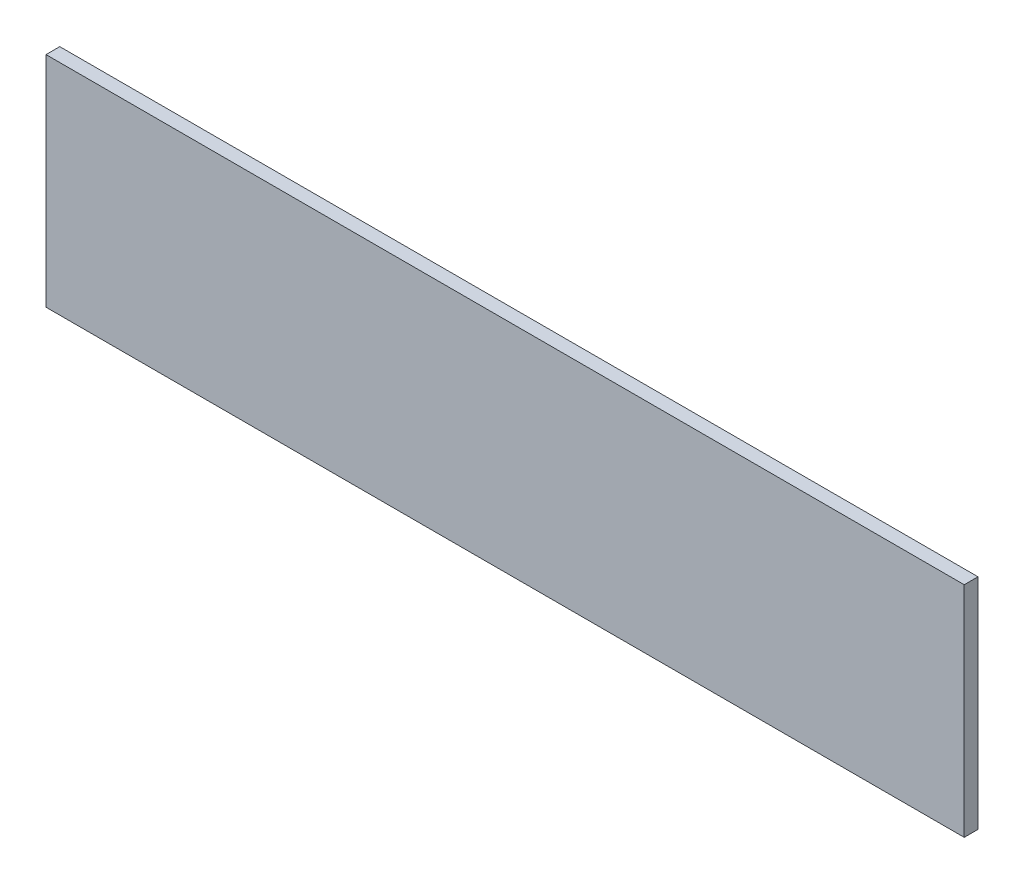
ISO-10303-21;
HEADER;
FILE_DESCRIPTION(('STEP AP214'),'2;1');
FILE_NAME('part.step','',(''),(''),'','','');
FILE_SCHEMA(('AUTOMOTIVE_DESIGN { 1 0 10303 214 1 1 1 1 }'));
ENDSEC;
DATA;
#1=APPLICATION_CONTEXT('core data for automotive mechanical design processes');
#2=APPLICATION_PROTOCOL_DEFINITION('international standard','automotive_design',2000,#1);
#3=PRODUCT_CONTEXT('',#1,'mechanical');
#4=PRODUCT('Part','Part','',(#3));
#5=PRODUCT_RELATED_PRODUCT_CATEGORY('part','',(#4));
#6=PRODUCT_DEFINITION_FORMATION('','',#4);
#7=PRODUCT_DEFINITION_CONTEXT('part definition',#1,'design');
#8=PRODUCT_DEFINITION('design','',#6,#7);
#9=PRODUCT_DEFINITION_SHAPE('','',#8);
#10=(LENGTH_UNIT() NAMED_UNIT(*) SI_UNIT(.MILLI.,.METRE.));
#11=(NAMED_UNIT(*) PLANE_ANGLE_UNIT() SI_UNIT($,.RADIAN.));
#12=(NAMED_UNIT(*) SI_UNIT($,.STERADIAN.) SOLID_ANGLE_UNIT());
#13=UNCERTAINTY_MEASURE_WITH_UNIT(LENGTH_MEASURE(1.E-05),#10,'distance_accuracy_value','');
#14=(GEOMETRIC_REPRESENTATION_CONTEXT(3) GLOBAL_UNCERTAINTY_ASSIGNED_CONTEXT((#13)) GLOBAL_UNIT_ASSIGNED_CONTEXT((#10,
#11,#12)) REPRESENTATION_CONTEXT('',''));
#15=CARTESIAN_POINT('',(0.,0.,0.));
#16=DIRECTION('',(0.,0.,1.));
#17=DIRECTION('',(1.,0.,0.));
#18=AXIS2_PLACEMENT_3D('',#15,#16,#17);
#19=CARTESIAN_POINT('',(-58.9085807986758,34.3840740740741,3.));
#20=DIRECTION('',(1.,0.,0.));
#21=DIRECTION('',(0.,0.,-1.));
#22=AXIS2_PLACEMENT_3D('',#19,#20,#21);
#23=PLANE('',#22);
#24=DIRECTION('',(0.,-1.,0.));
#25=VECTOR('',#24,1.);
#26=CARTESIAN_POINT('',(-58.9085807986758,34.3840740740741,0.));
#27=LINE('',#26,#25);
#28=CARTESIAN_POINT('',(-58.9085807986758,34.3840740740741,0.));
#29=VERTEX_POINT('',#28);
#30=CARTESIAN_POINT('',(-58.9085807986758,-13.2738518518519,0.));
#31=VERTEX_POINT('',#30);
#32=EDGE_CURVE('E96',#29,#31,#27,.T.);
#33=ORIENTED_EDGE('',*,*,#32,.T.);
#34=DIRECTION('',(0.,0.,-1.));
#35=VECTOR('',#34,1.);
#36=CARTESIAN_POINT('',(-58.9085807986758,-13.2738518518519,3.));
#37=LINE('',#36,#35);
#38=CARTESIAN_POINT('',(-58.9085807986758,-13.2738518518519,3.));
#39=VERTEX_POINT('',#38);
#40=EDGE_CURVE('E11',#39,#31,#37,.T.);
#41=ORIENTED_EDGE('',*,*,#40,.F.);
#42=DIRECTION('',(0.,-1.,0.));
#43=VECTOR('',#42,1.);
#44=CARTESIAN_POINT('',(-58.9085807986758,34.3840740740741,3.));
#45=LINE('',#44,#43);
#46=CARTESIAN_POINT('',(-58.9085807986758,34.3840740740741,3.));
#47=VERTEX_POINT('',#46);
#48=EDGE_CURVE('E84',#47,#39,#45,.T.);
#49=ORIENTED_EDGE('',*,*,#48,.F.);
#50=DIRECTION('',(0.,0.,-1.));
#51=VECTOR('',#50,1.);
#52=CARTESIAN_POINT('',(-58.9085807986758,34.3840740740741,3.));
#53=LINE('',#52,#51);
#54=EDGE_CURVE('E92',#47,#29,#53,.T.);
#55=ORIENTED_EDGE('',*,*,#54,.T.);
#56=EDGE_LOOP('',(#33,#41,#49,#55));
#57=FACE_BOUND('',#56,.T.);
#58=ADVANCED_FACE('F33',(#57),#23,.F.);
#59=CARTESIAN_POINT('',(-58.9085807986758,-13.2738518518519,3.));
#60=DIRECTION('',(0.,1.,0.));
#61=DIRECTION('',(0.,0.,1.));
#62=AXIS2_PLACEMENT_3D('',#59,#60,#61);
#63=PLANE('',#62);
#64=DIRECTION('',(1.,0.,0.));
#65=VECTOR('',#64,1.);
#66=CARTESIAN_POINT('',(-58.9085807986758,-13.2738518518519,0.));
#67=LINE('',#66,#65);
#68=CARTESIAN_POINT('',(141.091419201324,-13.2738518518519,0.));
#69=VERTEX_POINT('',#68);
#70=EDGE_CURVE('E88',#31,#69,#67,.T.);
#71=ORIENTED_EDGE('',*,*,#70,.T.);
#72=DIRECTION('',(0.,0.,-1.));
#73=VECTOR('',#72,1.);
#74=CARTESIAN_POINT('',(141.091419201324,-13.2738518518519,3.));
#75=LINE('',#74,#73);
#76=CARTESIAN_POINT('',(141.091419201324,-13.2738518518519,3.));
#77=VERTEX_POINT('',#76);
#78=EDGE_CURVE('E41',#77,#69,#75,.T.);
#79=ORIENTED_EDGE('',*,*,#78,.F.);
#80=DIRECTION('',(1.,0.,0.));
#81=VECTOR('',#80,1.);
#82=CARTESIAN_POINT('',(-58.9085807986758,-13.2738518518519,3.));
#83=LINE('',#82,#81);
#84=EDGE_CURVE('E79',#39,#77,#83,.T.);
#85=ORIENTED_EDGE('',*,*,#84,.F.);
#86=ORIENTED_EDGE('',*,*,#40,.T.);
#87=EDGE_LOOP('',(#71,#79,#85,#86));
#88=FACE_BOUND('',#87,.T.);
#89=ADVANCED_FACE('F87',(#88),#63,.F.);
#90=CARTESIAN_POINT('',(141.091419201324,34.3840740740741,3.));
#91=DIRECTION('',(-1.,0.,0.));
#92=DIRECTION('',(0.,0.,1.));
#93=AXIS2_PLACEMENT_3D('',#90,#91,#92);
#94=PLANE('',#93);
#95=DIRECTION('',(0.,1.,0.));
#96=VECTOR('',#95,1.);
#97=CARTESIAN_POINT('',(141.091419201324,34.3840740740741,0.));
#98=LINE('',#97,#96);
#99=CARTESIAN_POINT('',(141.091419201324,34.3840740740741,0.));
#100=VERTEX_POINT('',#99);
#101=EDGE_CURVE('E66',#69,#100,#98,.T.);
#102=ORIENTED_EDGE('',*,*,#101,.T.);
#103=DIRECTION('',(0.,0.,-1.));
#104=VECTOR('',#103,1.);
#105=CARTESIAN_POINT('',(141.091419201324,34.3840740740741,3.));
#106=LINE('',#105,#104);
#107=CARTESIAN_POINT('',(141.091419201324,34.3840740740741,3.));
#108=VERTEX_POINT('',#107);
#109=EDGE_CURVE('E89',#108,#100,#106,.T.);
#110=ORIENTED_EDGE('',*,*,#109,.F.);
#111=DIRECTION('',(0.,1.,0.));
#112=VECTOR('',#111,1.);
#113=CARTESIAN_POINT('',(141.091419201324,34.3840740740741,3.));
#114=LINE('',#113,#112);
#115=EDGE_CURVE('E82',#77,#108,#114,.T.);
#116=ORIENTED_EDGE('',*,*,#115,.F.);
#117=ORIENTED_EDGE('',*,*,#78,.T.);
#118=EDGE_LOOP('',(#102,#110,#116,#117));
#119=FACE_BOUND('',#118,.T.);
#120=ADVANCED_FACE('F90',(#119),#94,.F.);
#121=CARTESIAN_POINT('',(-58.9085807986758,34.3840740740741,3.));
#122=DIRECTION('',(0.,-1.,0.));
#123=DIRECTION('',(0.,0.,-1.));
#124=AXIS2_PLACEMENT_3D('',#121,#122,#123);
#125=PLANE('',#124);
#126=DIRECTION('',(-1.,0.,0.));
#127=VECTOR('',#126,1.);
#128=CARTESIAN_POINT('',(-58.9085807986758,34.3840740740741,0.));
#129=LINE('',#128,#127);
#130=EDGE_CURVE('E72',#100,#29,#129,.T.);
#131=ORIENTED_EDGE('',*,*,#130,.T.);
#132=ORIENTED_EDGE('',*,*,#54,.F.);
#133=DIRECTION('',(-1.,0.,0.));
#134=VECTOR('',#133,1.);
#135=CARTESIAN_POINT('',(-58.9085807986758,34.3840740740741,3.));
#136=LINE('',#135,#134);
#137=EDGE_CURVE('E49',#108,#47,#136,.T.);
#138=ORIENTED_EDGE('',*,*,#137,.F.);
#139=ORIENTED_EDGE('',*,*,#109,.T.);
#140=EDGE_LOOP('',(#131,#132,#138,#139));
#141=FACE_BOUND('',#140,.T.);
#142=ADVANCED_FACE('F103',(#141),#125,.F.);
#143=CARTESIAN_POINT('',(0.,0.,3.));
#144=DIRECTION('',(0.,0.,1.));
#145=DIRECTION('',(1.,0.,0.));
#146=AXIS2_PLACEMENT_3D('',#143,#144,#145);
#147=PLANE('',#146);
#148=ORIENTED_EDGE('',*,*,#48,.T.);
#149=ORIENTED_EDGE('',*,*,#84,.T.);
#150=ORIENTED_EDGE('',*,*,#115,.T.);
#151=ORIENTED_EDGE('',*,*,#137,.T.);
#152=EDGE_LOOP('',(#148,#149,#150,#151));
#153=FACE_BOUND('',#152,.T.);
#154=ADVANCED_FACE('F80',(#153),#147,.T.);
#155=CARTESIAN_POINT('',(0.,0.,0.));
#156=DIRECTION('',(0.,0.,1.));
#157=DIRECTION('',(1.,0.,0.));
#158=AXIS2_PLACEMENT_3D('',#155,#156,#157);
#159=PLANE('',#158);
#160=ORIENTED_EDGE('',*,*,#32,.F.);
#161=ORIENTED_EDGE('',*,*,#130,.F.);
#162=ORIENTED_EDGE('',*,*,#101,.F.);
#163=ORIENTED_EDGE('',*,*,#70,.F.);
#164=EDGE_LOOP('',(#160,#161,#162,#163));
#165=FACE_BOUND('',#164,.T.);
#166=ADVANCED_FACE('F106',(#165),#159,.F.);
#167=CLOSED_SHELL('',(#58,#89,#120,#142,#154,#166));
#168=MANIFOLD_SOLID_BREP('B2',#167);
#169=ADVANCED_BREP_SHAPE_REPRESENTATION('',(#18,#168),#14);
#170=SHAPE_DEFINITION_REPRESENTATION(#9,#169);
ENDSEC;
END-ISO-10303-21;
